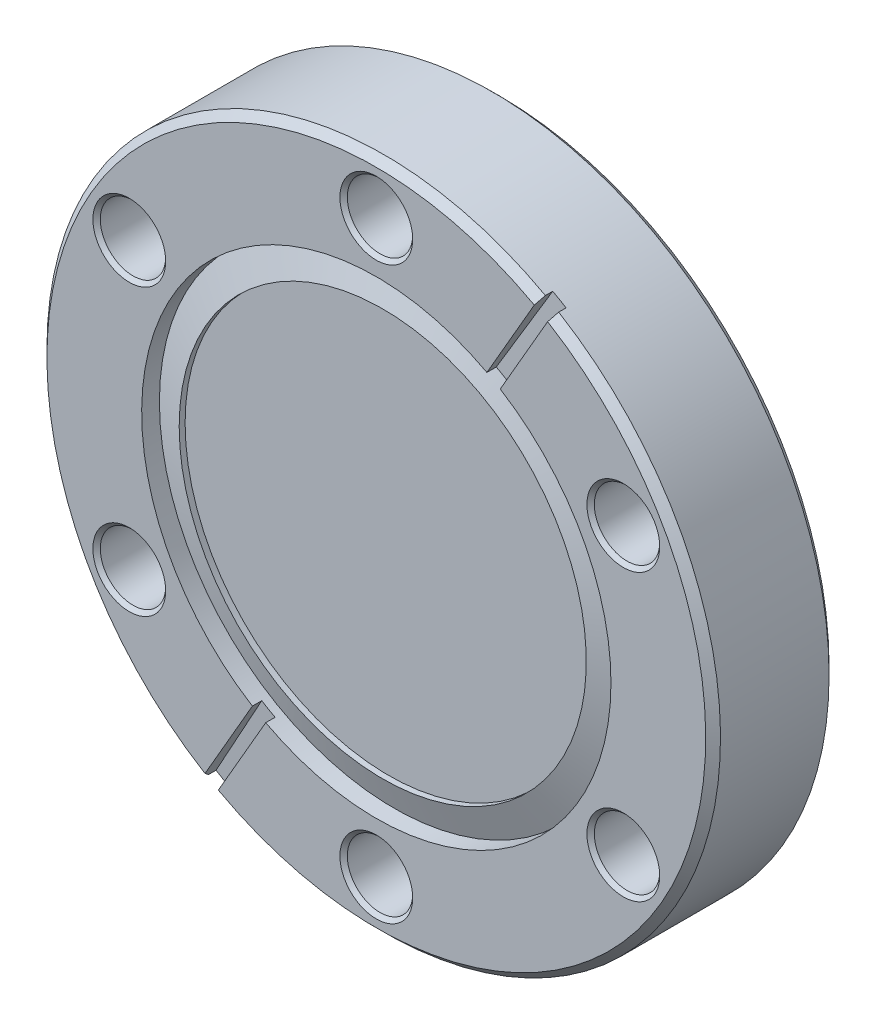
ISO-10303-21;
HEADER;
FILE_DESCRIPTION(('STEP AP214'),'2;1');
FILE_NAME('part.step','',(''),(''),'','','');
FILE_SCHEMA(('AUTOMOTIVE_DESIGN { 1 0 10303 214 1 1 1 1 }'));
ENDSEC;
DATA;
#1=APPLICATION_CONTEXT('core data for automotive mechanical design processes');
#2=APPLICATION_PROTOCOL_DEFINITION('international standard','automotive_design',2000,#1);
#3=PRODUCT_CONTEXT('',#1,'mechanical');
#4=PRODUCT('Part','Part','',(#3));
#5=PRODUCT_RELATED_PRODUCT_CATEGORY('part','',(#4));
#6=PRODUCT_DEFINITION_FORMATION('','',#4);
#7=PRODUCT_DEFINITION_CONTEXT('part definition',#1,'design');
#8=PRODUCT_DEFINITION('design','',#6,#7);
#9=PRODUCT_DEFINITION_SHAPE('','',#8);
#10=(LENGTH_UNIT() NAMED_UNIT(*) SI_UNIT(.MILLI.,.METRE.));
#11=(NAMED_UNIT(*) PLANE_ANGLE_UNIT() SI_UNIT($,.RADIAN.));
#12=(NAMED_UNIT(*) SI_UNIT($,.STERADIAN.) SOLID_ANGLE_UNIT());
#13=UNCERTAINTY_MEASURE_WITH_UNIT(LENGTH_MEASURE(1.E-05),#10,'distance_accuracy_value','');
#14=(GEOMETRIC_REPRESENTATION_CONTEXT(3) GLOBAL_UNCERTAINTY_ASSIGNED_CONTEXT((#13)) GLOBAL_UNIT_ASSIGNED_CONTEXT((#10,
#11,#12)) REPRESENTATION_CONTEXT('',''));
#15=CARTESIAN_POINT('',(0.,0.,0.));
#16=DIRECTION('',(0.,0.,1.));
#17=DIRECTION('',(1.,0.,0.));
#18=AXIS2_PLACEMENT_3D('',#15,#16,#17);
#19=CARTESIAN_POINT('',(0.,0.,0.));
#20=DIRECTION('',(0.,0.,-1.));
#21=DIRECTION('',(-1.,0.,0.));
#22=AXIS2_PLACEMENT_3D('',#19,#20,#21);
#23=CYLINDRICAL_SURFACE('',#22,34.671);
#24=CARTESIAN_POINT('',(0.,0.,-11.9379999999998));
#25=DIRECTION('',(0.,0.,-1.));
#26=DIRECTION('',(-1.,0.,0.));
#27=AXIS2_PLACEMENT_3D('',#24,#25,#26);
#28=CIRCLE('',#27,34.671);
#29=CARTESIAN_POINT('',(-34.671,0.,-11.9379999999998));
#30=VERTEX_POINT('',#29);
#31=EDGE_CURVE('E448',#30,#30,#28,.F.);
#32=ORIENTED_EDGE('',*,*,#31,.T.);
#33=EDGE_LOOP('',(#32));
#34=FACE_BOUND('',#33,.T.);
#35=DIRECTION('',(0.,0.,-1.));
#36=VECTOR('',#35,1.);
#37=CARTESIAN_POINT('',(-18.0183640857662,-29.6212220658203,-0.96573949798635));
#38=LINE('',#37,#36);
#39=CARTESIAN_POINT('',(-18.0183640857662,-29.6212220658203,-0.761999999999931));
#40=VERTEX_POINT('',#39);
#41=CARTESIAN_POINT('',(-18.0183640857667,-29.6212220658211,-1.51704615798749));
#42=VERTEX_POINT('',#41);
#43=EDGE_CURVE('E169',#40,#42,#38,.T.);
#44=ORIENTED_EDGE('',*,*,#43,.F.);
#45=CARTESIAN_POINT('',(0.,0.,-0.761999999999931));
#46=DIRECTION('',(0.,0.,-1.));
#47=DIRECTION('',(-1.,0.,0.));
#48=AXIS2_PLACEMENT_3D('',#45,#46,#47);
#49=CIRCLE('',#48,34.671);
#50=CARTESIAN_POINT('',(16.6435487572577,30.4149720658207,-0.761999999998031));
#51=VERTEX_POINT('',#50);
#52=EDGE_CURVE('E345',#40,#51,#49,.T.);
#53=ORIENTED_EDGE('',*,*,#52,.T.);
#54=DIRECTION('',(0.,0.,-1.));
#55=VECTOR('',#54,1.);
#56=CARTESIAN_POINT('',(16.6435487572577,30.4149720658207,-0.96573949798635));
#57=LINE('',#56,#55);
#58=CARTESIAN_POINT('',(16.6435487572579,30.4149720658217,-1.51704615798749));
#59=VERTEX_POINT('',#58);
#60=EDGE_CURVE('E167',#51,#59,#57,.T.);
#61=ORIENTED_EDGE('',*,*,#60,.T.);
#62=CARTESIAN_POINT('',(0.,0.,0.299507719817739));
#63=DIRECTION('',(-0.0261679781214693,-0.0453242676377388,-0.998629534754574));
#64=DIRECTION('',(0.499314767377261,0.864838546066911,-0.0523359562429414));
#65=AXIS2_PLACEMENT_3D('',#62,#63,#64);
#66=ELLIPSE('',#65,34.7185806080939,34.671);
#67=CARTESIAN_POINT('',(18.0183640857672,29.6212220658219,-1.51704615798749));
#68=VERTEX_POINT('',#67);
#69=EDGE_CURVE('E259',#59,#68,#66,.T.);
#70=ORIENTED_EDGE('',*,*,#69,.T.);
#71=DIRECTION('',(0.,0.,-1.));
#72=VECTOR('',#71,1.);
#73=CARTESIAN_POINT('',(18.018364085766,29.6212220658226,-0.965739497986353));
#74=LINE('',#73,#72);
#75=CARTESIAN_POINT('',(18.018364085766,29.6212220658226,-0.761999999999943));
#76=VERTEX_POINT('',#75);
#77=EDGE_CURVE('E173',#76,#68,#74,.T.);
#78=ORIENTED_EDGE('',*,*,#77,.F.);
#79=CARTESIAN_POINT('',(0.,0.,-0.761999999999943));
#80=DIRECTION('',(0.,0.,-1.));
#81=DIRECTION('',(-1.,0.,0.));
#82=AXIS2_PLACEMENT_3D('',#79,#80,#81);
#83=CIRCLE('',#82,34.671);
#84=CARTESIAN_POINT('',(-16.6435487572595,-30.4149720658219,-0.761999999999942));
#85=VERTEX_POINT('',#84);
#86=EDGE_CURVE('E927',#76,#85,#83,.T.);
#87=ORIENTED_EDGE('',*,*,#86,.T.);
#88=DIRECTION('',(0.,0.,-1.));
#89=VECTOR('',#88,1.);
#90=CARTESIAN_POINT('',(-16.6435487572595,-30.4149720658219,-0.965739497986353));
#91=LINE('',#90,#89);
#92=CARTESIAN_POINT('',(-16.6435487572585,-30.4149720658224,-1.51704615798749));
#93=VERTEX_POINT('',#92);
#94=EDGE_CURVE('E171',#85,#93,#91,.T.);
#95=ORIENTED_EDGE('',*,*,#94,.T.);
#96=CARTESIAN_POINT('',(0.,0.,0.299507719817694));
#97=DIRECTION('',(-0.0261679781214693,-0.0453242676377388,0.998629534754574));
#98=DIRECTION('',(-0.499314767377261,-0.864838546066911,-0.0523359562429414));
#99=AXIS2_PLACEMENT_3D('',#96,#97,#98);
#100=ELLIPSE('',#99,34.7185806080939,34.671);
#101=EDGE_CURVE('E239',#42,#93,#100,.T.);
#102=ORIENTED_EDGE('',*,*,#101,.F.);
#103=EDGE_LOOP('',(#44,#53,#61,#70,#78,#87,#95,#102));
#104=FACE_BOUND('',#103,.T.);
#105=ADVANCED_FACE('F43',(#34,#104),#23,.T.);
#106=CARTESIAN_POINT('',(0.,0.,-1.91651285463287));
#107=DIRECTION('',(0.,0.,1.));
#108=DIRECTION('',(1.,0.,0.));
#109=AXIS2_PLACEMENT_3D('',#106,#107,#108);
#110=CYLINDRICAL_SURFACE('',#109,24.1554);
#111=CARTESIAN_POINT('',(0.,0.,0.29950771981774));
#112=DIRECTION('',(-0.0261679781214693,-0.0453242676377388,-0.998629534754574));
#113=DIRECTION('',(-0.499314767377261,-0.864838546066911,0.0523359562429414));
#114=AXIS2_PLACEMENT_3D('',#111,#112,#113);
#115=ELLIPSE('',#114,24.1885495665182,24.1554);
#116=CARTESIAN_POINT('',(12.7585852175989,20.511017829578,-0.965739497986353));
#117=VERTEX_POINT('',#116);
#118=CARTESIAN_POINT('',(11.3837698890904,21.3047678295784,-0.965739497986328));
#119=VERTEX_POINT('',#118);
#120=EDGE_CURVE('E310',#117,#119,#115,.F.);
#121=ORIENTED_EDGE('',*,*,#120,.T.);
#122=DIRECTION('',(0.,0.,-1.));
#123=VECTOR('',#122,1.);
#124=CARTESIAN_POINT('',(11.3837698890914,21.3047678295779,0.));
#125=LINE('',#124,#123);
#126=CARTESIAN_POINT('',(11.3837698890914,21.3047678295779,0.));
#127=VERTEX_POINT('',#126);
#128=EDGE_CURVE('E143',#127,#119,#125,.T.);
#129=ORIENTED_EDGE('',*,*,#128,.F.);
#130=CARTESIAN_POINT('',(0.,0.,0.));
#131=DIRECTION('',(0.,0.,-1.));
#132=DIRECTION('',(1.,0.,0.));
#133=AXIS2_PLACEMENT_3D('',#130,#131,#132);
#134=CIRCLE('',#133,24.1554);
#135=CARTESIAN_POINT('',(-12.7585852175989,-20.511017829578,0.));
#136=VERTEX_POINT('',#135);
#137=EDGE_CURVE('E127',#136,#127,#134,.T.);
#138=ORIENTED_EDGE('',*,*,#137,.F.);
#139=DIRECTION('',(0.,0.,-1.));
#140=VECTOR('',#139,1.);
#141=CARTESIAN_POINT('',(-12.7585852175989,-20.511017829578,0.));
#142=LINE('',#141,#140);
#143=CARTESIAN_POINT('',(-12.7585852175989,-20.511017829578,-0.965739497986328));
#144=VERTEX_POINT('',#143);
#145=EDGE_CURVE('E136',#136,#144,#142,.T.);
#146=ORIENTED_EDGE('',*,*,#145,.T.);
#147=CARTESIAN_POINT('',(0.,0.,0.299507719817694));
#148=DIRECTION('',(-0.0261679781214693,-0.0453242676377388,0.998629534754574));
#149=DIRECTION('',(0.499314767377261,0.864838546066911,0.0523359562429414));
#150=AXIS2_PLACEMENT_3D('',#147,#148,#149);
#151=ELLIPSE('',#150,24.1885495665182,24.1554);
#152=CARTESIAN_POINT('',(-11.3837698890905,-21.3047678295783,-0.965739497986353));
#153=VERTEX_POINT('',#152);
#154=EDGE_CURVE('E244',#153,#144,#151,.F.);
#155=ORIENTED_EDGE('',*,*,#154,.F.);
#156=DIRECTION('',(0.,0.,-1.));
#157=VECTOR('',#156,1.);
#158=CARTESIAN_POINT('',(-11.3837698890914,-21.3047678295779,0.));
#159=LINE('',#158,#157);
#160=CARTESIAN_POINT('',(-11.3837698890914,-21.3047678295779,0.));
#161=VERTEX_POINT('',#160);
#162=EDGE_CURVE('E161',#161,#153,#159,.T.);
#163=ORIENTED_EDGE('',*,*,#162,.F.);
#164=CARTESIAN_POINT('',(0.,0.,0.));
#165=DIRECTION('',(0.,0.,-1.));
#166=DIRECTION('',(1.,0.,0.));
#167=AXIS2_PLACEMENT_3D('',#164,#165,#166);
#168=CIRCLE('',#167,24.1554);
#169=CARTESIAN_POINT('',(12.758585217598,20.5110178295785,0.));
#170=VERTEX_POINT('',#169);
#171=EDGE_CURVE('E157',#170,#161,#168,.T.);
#172=ORIENTED_EDGE('',*,*,#171,.F.);
#173=DIRECTION('',(0.,0.,-1.));
#174=VECTOR('',#173,1.);
#175=CARTESIAN_POINT('',(12.758585217598,20.5110178295785,0.));
#176=LINE('',#175,#174);
#177=EDGE_CURVE('E164',#170,#117,#176,.T.);
#178=ORIENTED_EDGE('',*,*,#177,.T.);
#179=EDGE_LOOP('',(#121,#129,#138,#146,#155,#163,#172,#178));
#180=FACE_BOUND('',#179,.T.);
#181=CARTESIAN_POINT('',(0.,0.,-1.82525033774552));
#182=DIRECTION('',(0.,0.,1.));
#183=DIRECTION('',(1.,0.,0.));
#184=AXIS2_PLACEMENT_3D('',#181,#182,#183);
#185=CIRCLE('',#184,24.1554);
#186=CARTESIAN_POINT('',(24.1554,0.,-1.82525033774552));
#187=VERTEX_POINT('',#186);
#188=EDGE_CURVE('E252',#187,#187,#185,.T.);
#189=ORIENTED_EDGE('',*,*,#188,.F.);
#190=EDGE_LOOP('',(#189));
#191=FACE_BOUND('',#190,.T.);
#192=ADVANCED_FACE('F146',(#180,#191),#110,.F.);
#193=CARTESIAN_POINT('',(0.,0.,-12.7));
#194=DIRECTION('',(0.,0.,-1.));
#195=DIRECTION('',(-1.,0.,0.));
#196=AXIS2_PLACEMENT_3D('',#193,#194,#195);
#197=PLANE('',#196);
#198=CARTESIAN_POINT('',(0.,0.,-12.7));
#199=DIRECTION('',(0.,0.,-1.));
#200=DIRECTION('',(-1.,0.,0.));
#201=AXIS2_PLACEMENT_3D('',#198,#199,#200);
#202=CIRCLE('',#201,33.909);
#203=CARTESIAN_POINT('',(-33.909,0.,-12.7));
#204=VERTEX_POINT('',#203);
#205=EDGE_CURVE('E12',#204,#204,#202,.T.);
#206=ORIENTED_EDGE('',*,*,#205,.T.);
#207=EDGE_LOOP('',(#206));
#208=FACE_BOUND('',#207,.T.);
#209=CARTESIAN_POINT('',(25.428584316085,-14.6812,-12.7));
#210=DIRECTION('',(0.,0.,-1.));
#211=DIRECTION('',(-1.,0.,0.));
#212=AXIS2_PLACEMENT_3D('',#209,#210,#211);
#213=CIRCLE('',#212,3.74649999997987);
#214=CARTESIAN_POINT('',(21.6820843161051,-14.6812,-12.7));
#215=VERTEX_POINT('',#214);
#216=EDGE_CURVE('E571',#215,#215,#213,.F.);
#217=ORIENTED_EDGE('',*,*,#216,.T.);
#218=EDGE_LOOP('',(#217));
#219=FACE_BOUND('',#218,.T.);
#220=CARTESIAN_POINT('',(0.,29.3624,-12.7));
#221=DIRECTION('',(0.,0.,-1.));
#222=DIRECTION('',(-1.,0.,0.));
#223=AXIS2_PLACEMENT_3D('',#220,#221,#222);
#224=CIRCLE('',#223,3.74649999997986);
#225=CARTESIAN_POINT('',(-3.74649999997986,29.3624,-12.7));
#226=VERTEX_POINT('',#225);
#227=EDGE_CURVE('E568',#226,#226,#224,.F.);
#228=ORIENTED_EDGE('',*,*,#227,.T.);
#229=EDGE_LOOP('',(#228));
#230=FACE_BOUND('',#229,.T.);
#231=CARTESIAN_POINT('',(-25.428584316085,-14.6812,-12.7));
#232=DIRECTION('',(0.,0.,-1.));
#233=DIRECTION('',(-1.,0.,0.));
#234=AXIS2_PLACEMENT_3D('',#231,#232,#233);
#235=CIRCLE('',#234,3.74649999997987);
#236=CARTESIAN_POINT('',(-29.1750843160649,-14.6812,-12.7));
#237=VERTEX_POINT('',#236);
#238=EDGE_CURVE('E563',#237,#237,#235,.F.);
#239=ORIENTED_EDGE('',*,*,#238,.T.);
#240=EDGE_LOOP('',(#239));
#241=FACE_BOUND('',#240,.T.);
#242=CARTESIAN_POINT('',(25.428584316085,14.6812,-12.7));
#243=DIRECTION('',(0.,0.,-1.));
#244=DIRECTION('',(-1.,0.,0.));
#245=AXIS2_PLACEMENT_3D('',#242,#243,#244);
#246=CIRCLE('',#245,3.74649999997985);
#247=CARTESIAN_POINT('',(21.6820843161051,14.6812,-12.7));
#248=VERTEX_POINT('',#247);
#249=EDGE_CURVE('E559',#248,#248,#246,.F.);
#250=ORIENTED_EDGE('',*,*,#249,.T.);
#251=EDGE_LOOP('',(#250));
#252=FACE_BOUND('',#251,.T.);
#253=CARTESIAN_POINT('',(0.,-29.3624,-12.7));
#254=DIRECTION('',(0.,0.,-1.));
#255=DIRECTION('',(-1.,0.,0.));
#256=AXIS2_PLACEMENT_3D('',#253,#254,#255);
#257=CIRCLE('',#256,3.74649999997986);
#258=CARTESIAN_POINT('',(-3.74649999997986,-29.3624,-12.7));
#259=VERTEX_POINT('',#258);
#260=EDGE_CURVE('E557',#259,#259,#257,.F.);
#261=ORIENTED_EDGE('',*,*,#260,.T.);
#262=EDGE_LOOP('',(#261));
#263=FACE_BOUND('',#262,.T.);
#264=CARTESIAN_POINT('',(-25.428584316085,14.6812,-12.7));
#265=DIRECTION('',(0.,0.,-1.));
#266=DIRECTION('',(-1.,0.,0.));
#267=AXIS2_PLACEMENT_3D('',#264,#265,#266);
#268=CIRCLE('',#267,3.74649999997987);
#269=CARTESIAN_POINT('',(-29.1750843160649,14.6812,-12.7));
#270=VERTEX_POINT('',#269);
#271=EDGE_CURVE('E258',#270,#270,#268,.F.);
#272=ORIENTED_EDGE('',*,*,#271,.T.);
#273=EDGE_LOOP('',(#272));
#274=FACE_BOUND('',#273,.T.);
#275=ADVANCED_FACE('F378',(#208,#219,#230,#241,#252,#263,#274),#197,.T.);
#276=CARTESIAN_POINT('',(0.,0.,-1.8252503377459));
#277=DIRECTION('',(0.,0.,-1.));
#278=DIRECTION('',(-1.,0.,0.));
#279=AXIS2_PLACEMENT_3D('',#276,#277,#278);
#280=CONICAL_SURFACE('',#279,24.1553999999999,1.2217304763958);
#281=CARTESIAN_POINT('',(0.,0.,-0.660399999999613));
#282=DIRECTION('',(0.,0.,1.));
#283=DIRECTION('',(-1.,0.,0.));
#284=AXIS2_PLACEMENT_3D('',#281,#282,#283);
#285=CIRCLE('',#284,20.955);
#286=CARTESIAN_POINT('',(-20.955,0.,-0.660399999999613));
#287=VERTEX_POINT('',#286);
#288=EDGE_CURVE('E931',#287,#287,#285,.T.);
#289=ORIENTED_EDGE('',*,*,#288,.F.);
#290=EDGE_LOOP('',(#289));
#291=FACE_BOUND('',#290,.T.);
#292=ORIENTED_EDGE('',*,*,#188,.T.);
#293=EDGE_LOOP('',(#292));
#294=FACE_BOUND('',#293,.T.);
#295=ADVANCED_FACE('F374',(#291,#294),#280,.T.);
#296=CARTESIAN_POINT('',(12.5111076642548,20.0823741334518,-0.9398));
#297=DIRECTION('',(-0.0261679781214693,-0.0453242676377388,-0.998629534754574));
#298=DIRECTION('',(0.,0.998971622769016,-0.0453397938045331));
#299=AXIS2_PLACEMENT_3D('',#296,#297,#298);
#300=PLANE('',#299);
#301=ORIENTED_EDGE('',*,*,#120,.F.);
#302=DIRECTION('',(0.499314767377303,0.864838546066885,-0.052335956242967));
#303=VECTOR('',#302,1.);
#304=CARTESIAN_POINT('',(12.7585852175996,20.5110178295789,-0.96573949798628));
#305=LINE('',#304,#303);
#306=EDGE_CURVE('E305',#117,#68,#305,.T.);
#307=ORIENTED_EDGE('',*,*,#306,.T.);
#308=ORIENTED_EDGE('',*,*,#69,.F.);
#309=DIRECTION('',(0.499314767377303,0.864838546066885,-0.052335956242967));
#310=VECTOR('',#309,1.);
#311=CARTESIAN_POINT('',(11.3837698890915,21.3047678295781,-0.96573949798628));
#312=LINE('',#311,#310);
#313=EDGE_CURVE('E318',#119,#59,#312,.T.);
#314=ORIENTED_EDGE('',*,*,#313,.F.);
#315=EDGE_LOOP('',(#301,#307,#308,#314));
#316=FACE_BOUND('',#315,.T.);
#317=ADVANCED_FACE('F371',(#316),#300,.F.);
#318=CARTESIAN_POINT('',(-11.1362923357452,-20.8761241334518,-0.9398));
#319=DIRECTION('',(-0.0261679781214693,-0.0453242676377388,0.998629534754574));
#320=DIRECTION('',(0.,-0.998971622769016,-0.0453397938045331));
#321=AXIS2_PLACEMENT_3D('',#318,#319,#320);
#322=PLANE('',#321);
#323=DIRECTION('',(-0.499314767377303,-0.864838546066885,-0.052335956242967));
#324=VECTOR('',#323,1.);
#325=CARTESIAN_POINT('',(-12.7585852175996,-20.5110178295789,-0.96573949798628));
#326=LINE('',#325,#324);
#327=EDGE_CURVE('E139',#144,#42,#326,.T.);
#328=ORIENTED_EDGE('',*,*,#327,.T.);
#329=ORIENTED_EDGE('',*,*,#101,.T.);
#330=DIRECTION('',(-0.499314767377303,-0.864838546066885,-0.052335956242967));
#331=VECTOR('',#330,1.);
#332=CARTESIAN_POINT('',(-11.3837698890915,-21.3047678295781,-0.96573949798628));
#333=LINE('',#332,#331);
#334=EDGE_CURVE('E175',#153,#93,#333,.T.);
#335=ORIENTED_EDGE('',*,*,#334,.F.);
#336=ORIENTED_EDGE('',*,*,#154,.T.);
#337=EDGE_LOOP('',(#328,#329,#335,#336));
#338=FACE_BOUND('',#337,.T.);
#339=ADVANCED_FACE('F332',(#338),#322,.T.);
#340=CARTESIAN_POINT('',(12.758585217598,20.5110178295785,-0.965739497986353));
#341=DIRECTION('',(0.866025403784439,-0.5,0.));
#342=DIRECTION('',(0.5,0.866025403784439,0.));
#343=AXIS2_PLACEMENT_3D('',#340,#341,#342);
#344=PLANE('',#343);
#345=DIRECTION('',(-0.5,-0.866025403784439,0.));
#346=VECTOR('',#345,1.);
#347=CARTESIAN_POINT('',(12.758585217598,20.5110178295785,0.));
#348=LINE('',#347,#346);
#349=CARTESIAN_POINT('',(17.6372619552014,28.9611338128119,0.));
#350=VERTEX_POINT('',#349);
#351=EDGE_CURVE('E142',#350,#170,#348,.T.);
#352=ORIENTED_EDGE('',*,*,#351,.F.);
#353=CARTESIAN_POINT('',(17.6372619552014,28.9611338128119,0.));
#354=CARTESIAN_POINT('',(17.7007791661182,29.0711488492748,-0.126999621586548));
#355=CARTESIAN_POINT('',(17.764296282457,29.1811637219239,-0.253999432379819));
#356=CARTESIAN_POINT('',(17.8913303259785,29.4011931395941,-0.507999432379799));
#357=CARTESIAN_POINT('',(17.9548472531613,29.5112076846153,-0.634999621586509));
#358=CARTESIAN_POINT('',(18.018364085766,29.6212220658226,-0.76199999999994));
#359=B_SPLINE_CURVE_WITH_KNOTS('',3,(#353,#354,#355,#356,#357,#358),.UNSPECIFIED.,.F.,.F.,(4,2,
4),(0.,0.538887589318551,1.07777517863708),.UNSPECIFIED.);
#360=EDGE_CURVE('E65',#350,#76,#359,.T.);
#361=ORIENTED_EDGE('',*,*,#360,.T.);
#362=ORIENTED_EDGE('',*,*,#77,.T.);
#363=ORIENTED_EDGE('',*,*,#306,.F.);
#364=ORIENTED_EDGE('',*,*,#177,.F.);
#365=EDGE_LOOP('',(#352,#361,#362,#363,#364));
#366=FACE_BOUND('',#365,.T.);
#367=ADVANCED_FACE('F362',(#366),#344,.F.);
#368=CARTESIAN_POINT('',(-16.6435487572595,-30.4149720658219,-0.965739497986353));
#369=DIRECTION('',(0.866025403784439,-0.5,0.));
#370=DIRECTION('',(0.5,0.866025403784439,0.));
#371=AXIS2_PLACEMENT_3D('',#368,#369,#370);
#372=PLANE('',#371);
#373=ORIENTED_EDGE('',*,*,#94,.F.);
#374=CARTESIAN_POINT('',(-16.6435487572595,-30.4149720658219,-0.761999999999943));
#375=CARTESIAN_POINT('',(-16.5800319246548,-30.3049576846146,-0.63499962158651));
#376=CARTESIAN_POINT('',(-16.516514997472,-30.1949431395934,-0.5079994323798));
#377=CARTESIAN_POINT('',(-16.3894809539505,-29.9749137219231,-0.253999432379819));
#378=CARTESIAN_POINT('',(-16.3259638376117,-29.8648988492741,-0.126999621586548));
#379=CARTESIAN_POINT('',(-16.2624466266949,-29.7548838128111,0.));
#380=B_SPLINE_CURVE_WITH_KNOTS('',3,(#374,#375,#376,#377,#378,#379),.UNSPECIFIED.,.F.,.F.,(4,2,
4),(0.,0.538887589318528,1.07777517863708),.UNSPECIFIED.);
#381=CARTESIAN_POINT('',(-16.2624466266949,-29.7548838128111,0.));
#382=VERTEX_POINT('',#381);
#383=EDGE_CURVE('E51',#85,#382,#380,.T.);
#384=ORIENTED_EDGE('',*,*,#383,.T.);
#385=DIRECTION('',(-0.500000000000017,-0.866025403784429,0.));
#386=VECTOR('',#385,1.);
#387=CARTESIAN_POINT('',(-16.6435487572595,-30.4149720658219,0.));
#388=LINE('',#387,#386);
#389=EDGE_CURVE('E159',#161,#382,#388,.T.);
#390=ORIENTED_EDGE('',*,*,#389,.F.);
#391=ORIENTED_EDGE('',*,*,#162,.T.);
#392=ORIENTED_EDGE('',*,*,#334,.T.);
#393=EDGE_LOOP('',(#373,#384,#390,#391,#392));
#394=FACE_BOUND('',#393,.T.);
#395=ADVANCED_FACE('F336',(#394),#372,.F.);
#396=CARTESIAN_POINT('',(16.6435487572577,30.4149720658207,-0.96573949798635));
#397=DIRECTION('',(-0.866025403784475,0.499999999999937,0.));
#398=DIRECTION('',(-0.499999999999937,-0.866025403784475,0.));
#399=AXIS2_PLACEMENT_3D('',#396,#397,#398);
#400=PLANE('',#399);
#401=ORIENTED_EDGE('',*,*,#60,.F.);
#402=CARTESIAN_POINT('',(16.6435487572587,30.4149720658224,-0.761999999999931));
#403=CARTESIAN_POINT('',(16.5800319246539,30.3049576846151,-0.634999621586504));
#404=CARTESIAN_POINT('',(16.5165149974712,30.1949431395938,-0.5079994323798));
#405=CARTESIAN_POINT('',(16.3894809539497,29.9749137219236,-0.25399943237983));
#406=CARTESIAN_POINT('',(16.3259638376109,29.8648988492745,-0.126999621586565));
#407=CARTESIAN_POINT('',(16.2624466266941,29.7548838128116,0.));
#408=B_SPLINE_CURVE_WITH_KNOTS('',3,(#402,#403,#404,#405,#406,#407),.UNSPECIFIED.,.F.,.F.,(4,2,
4),(0.,0.538887589318506,1.07777517863704),.UNSPECIFIED.);
#409=CARTESIAN_POINT('',(16.2624466266941,29.7548838128116,0.));
#410=VERTEX_POINT('',#409);
#411=EDGE_CURVE('E342',#51,#410,#408,.T.);
#412=ORIENTED_EDGE('',*,*,#411,.T.);
#413=DIRECTION('',(0.499999999999937,0.866025403784475,0.));
#414=VECTOR('',#413,1.);
#415=CARTESIAN_POINT('',(16.6435487572587,30.4149720658224,0.));
#416=LINE('',#415,#414);
#417=EDGE_CURVE('E150',#127,#410,#416,.T.);
#418=ORIENTED_EDGE('',*,*,#417,.F.);
#419=ORIENTED_EDGE('',*,*,#128,.T.);
#420=ORIENTED_EDGE('',*,*,#313,.T.);
#421=EDGE_LOOP('',(#401,#412,#418,#419,#420));
#422=FACE_BOUND('',#421,.T.);
#423=ADVANCED_FACE('F453',(#422),#400,.F.);
#424=CARTESIAN_POINT('',(-12.7585852175989,-20.511017829578,-0.96573949798635));
#425=DIRECTION('',(-0.866025403784421,0.500000000000031,0.));
#426=DIRECTION('',(-0.500000000000031,-0.866025403784421,0.));
#427=AXIS2_PLACEMENT_3D('',#424,#425,#426);
#428=PLANE('',#427);
#429=DIRECTION('',(0.500000000000031,0.866025403784421,0.));
#430=VECTOR('',#429,1.);
#431=CARTESIAN_POINT('',(-12.7585852175989,-20.511017829578,0.));
#432=LINE('',#431,#430);
#433=CARTESIAN_POINT('',(-17.6372619552025,-28.9611338128112,0.));
#434=VERTEX_POINT('',#433);
#435=EDGE_CURVE('E122',#434,#136,#432,.T.);
#436=ORIENTED_EDGE('',*,*,#435,.F.);
#437=CARTESIAN_POINT('',(-17.6372619552025,-28.9611338128112,0.));
#438=CARTESIAN_POINT('',(-17.7007791661193,-29.0711488492742,-0.126999621586565));
#439=CARTESIAN_POINT('',(-17.7642962824581,-29.1811637219232,-0.25399943237983));
#440=CARTESIAN_POINT('',(-17.8913303259796,-29.4011931395934,-0.507999432379799));
#441=CARTESIAN_POINT('',(-17.9548472531624,-29.5112076846146,-0.634999621586504));
#442=CARTESIAN_POINT('',(-18.0183640857672,-29.6212220658219,-0.761999999999932));
#443=B_SPLINE_CURVE_WITH_KNOTS('',3,(#437,#438,#439,#440,#441,#442),.UNSPECIFIED.,.F.,.F.,(4,2,
4),(0.,0.538887589318532,1.07777517863703),.UNSPECIFIED.);
#444=EDGE_CURVE('E442',#434,#40,#443,.T.);
#445=ORIENTED_EDGE('',*,*,#444,.T.);
#446=ORIENTED_EDGE('',*,*,#43,.T.);
#447=ORIENTED_EDGE('',*,*,#327,.F.);
#448=ORIENTED_EDGE('',*,*,#145,.F.);
#449=EDGE_LOOP('',(#436,#445,#446,#447,#448));
#450=FACE_BOUND('',#449,.T.);
#451=ADVANCED_FACE('F137',(#450),#428,.F.);
#452=CARTESIAN_POINT('',(0.,0.,0.));
#453=DIRECTION('',(0.,0.,-1.));
#454=DIRECTION('',(-1.,0.,0.));
#455=AXIS2_PLACEMENT_3D('',#452,#453,#454);
#456=PLANE('',#455);
#457=CARTESIAN_POINT('',(25.428584316085,14.6812,0.));
#458=DIRECTION('',(0.,0.,-1.));
#459=DIRECTION('',(-1.,0.,0.));
#460=AXIS2_PLACEMENT_3D('',#457,#458,#459);
#461=CIRCLE('',#460,3.74649999997985);
#462=CARTESIAN_POINT('',(21.6820843161051,14.6812,0.));
#463=VERTEX_POINT('',#462);
#464=EDGE_CURVE('E532',#463,#463,#461,.T.);
#465=ORIENTED_EDGE('',*,*,#464,.T.);
#466=EDGE_LOOP('',(#465));
#467=FACE_BOUND('',#466,.T.);
#468=CARTESIAN_POINT('',(25.428584316085,-14.6812,0.));
#469=DIRECTION('',(0.,0.,-1.));
#470=DIRECTION('',(-1.,0.,0.));
#471=AXIS2_PLACEMENT_3D('',#468,#469,#470);
#472=CIRCLE('',#471,3.74649999997981);
#473=CARTESIAN_POINT('',(21.6820843161052,-14.6812,0.));
#474=VERTEX_POINT('',#473);
#475=EDGE_CURVE('E529',#474,#474,#472,.T.);
#476=ORIENTED_EDGE('',*,*,#475,.T.);
#477=EDGE_LOOP('',(#476));
#478=FACE_BOUND('',#477,.T.);
#479=CARTESIAN_POINT('',(0.,-29.3624,0.));
#480=DIRECTION('',(0.,0.,-1.));
#481=DIRECTION('',(-1.,0.,0.));
#482=AXIS2_PLACEMENT_3D('',#479,#480,#481);
#483=CIRCLE('',#482,3.74649999997984);
#484=CARTESIAN_POINT('',(-3.74649999997984,-29.3624,0.));
#485=VERTEX_POINT('',#484);
#486=EDGE_CURVE('E526',#485,#485,#483,.T.);
#487=ORIENTED_EDGE('',*,*,#486,.T.);
#488=EDGE_LOOP('',(#487));
#489=FACE_BOUND('',#488,.T.);
#490=ORIENTED_EDGE('',*,*,#389,.T.);
#491=CARTESIAN_POINT('',(0.,0.,0.));
#492=DIRECTION('',(0.,0.,-1.));
#493=DIRECTION('',(-1.,0.,0.));
#494=AXIS2_PLACEMENT_3D('',#491,#492,#493);
#495=CIRCLE('',#494,33.9089999999998);
#496=EDGE_CURVE('E339',#382,#350,#495,.F.);
#497=ORIENTED_EDGE('',*,*,#496,.T.);
#498=ORIENTED_EDGE('',*,*,#351,.T.);
#499=ORIENTED_EDGE('',*,*,#171,.T.);
#500=EDGE_LOOP('',(#490,#497,#498,#499));
#501=FACE_BOUND('',#500,.T.);
#502=ADVANCED_FACE('F338',(#467,#478,#489,#501),#456,.F.);
#503=CARTESIAN_POINT('',(0.,0.,0.));
#504=DIRECTION('',(0.,0.,-1.));
#505=DIRECTION('',(-1.,0.,0.));
#506=AXIS2_PLACEMENT_3D('',#503,#504,#505);
#507=PLANE('',#506);
#508=CARTESIAN_POINT('',(0.,29.3624,0.));
#509=DIRECTION('',(0.,0.,-1.));
#510=DIRECTION('',(-1.,0.,0.));
#511=AXIS2_PLACEMENT_3D('',#508,#509,#510);
#512=CIRCLE('',#511,3.74649999997981);
#513=CARTESIAN_POINT('',(-3.74649999997981,29.3624,0.));
#514=VERTEX_POINT('',#513);
#515=EDGE_CURVE('E523',#514,#514,#512,.T.);
#516=ORIENTED_EDGE('',*,*,#515,.T.);
#517=EDGE_LOOP('',(#516));
#518=FACE_BOUND('',#517,.T.);
#519=CARTESIAN_POINT('',(-25.428584316085,-14.6812,0.));
#520=DIRECTION('',(0.,0.,-1.));
#521=DIRECTION('',(-1.,0.,0.));
#522=AXIS2_PLACEMENT_3D('',#519,#520,#521);
#523=CIRCLE('',#522,3.74649999997983);
#524=CARTESIAN_POINT('',(-29.1750843160648,-14.6812,0.));
#525=VERTEX_POINT('',#524);
#526=EDGE_CURVE('E520',#525,#525,#523,.T.);
#527=ORIENTED_EDGE('',*,*,#526,.T.);
#528=EDGE_LOOP('',(#527));
#529=FACE_BOUND('',#528,.T.);
#530=CARTESIAN_POINT('',(-25.428584316085,14.6812,0.));
#531=DIRECTION('',(0.,0.,-1.));
#532=DIRECTION('',(-1.,0.,0.));
#533=AXIS2_PLACEMENT_3D('',#530,#531,#532);
#534=CIRCLE('',#533,3.74649999997983);
#535=CARTESIAN_POINT('',(-29.1750843160648,14.6812,0.));
#536=VERTEX_POINT('',#535);
#537=EDGE_CURVE('E517',#536,#536,#534,.T.);
#538=ORIENTED_EDGE('',*,*,#537,.T.);
#539=EDGE_LOOP('',(#538));
#540=FACE_BOUND('',#539,.T.);
#541=ORIENTED_EDGE('',*,*,#417,.T.);
#542=CARTESIAN_POINT('',(0.,0.,0.));
#543=DIRECTION('',(0.,0.,-1.));
#544=DIRECTION('',(-1.,0.,0.));
#545=AXIS2_PLACEMENT_3D('',#542,#543,#544);
#546=CIRCLE('',#545,33.9089999999999);
#547=EDGE_CURVE('E130',#410,#434,#546,.F.);
#548=ORIENTED_EDGE('',*,*,#547,.T.);
#549=ORIENTED_EDGE('',*,*,#435,.T.);
#550=ORIENTED_EDGE('',*,*,#137,.T.);
#551=EDGE_LOOP('',(#541,#548,#549,#550));
#552=FACE_BOUND('',#551,.T.);
#553=ADVANCED_FACE('F125',(#518,#529,#540,#552),#507,.F.);
#554=CARTESIAN_POINT('',(0.,0.,-1.27));
#555=DIRECTION('',(0.,0.,1.));
#556=DIRECTION('',(1.,0.,0.));
#557=AXIS2_PLACEMENT_3D('',#554,#555,#556);
#558=CYLINDRICAL_SURFACE('',#557,20.955);
#559=CARTESIAN_POINT('',(0.,0.,-1.27));
#560=DIRECTION('',(0.,0.,1.));
#561=DIRECTION('',(-1.,0.,0.));
#562=AXIS2_PLACEMENT_3D('',#559,#560,#561);
#563=CIRCLE('',#562,20.955);
#564=CARTESIAN_POINT('',(-20.955,0.,-1.27));
#565=VERTEX_POINT('',#564);
#566=EDGE_CURVE('E132',#565,#565,#563,.T.);
#567=ORIENTED_EDGE('',*,*,#566,.F.);
#568=EDGE_LOOP('',(#567));
#569=FACE_BOUND('',#568,.T.);
#570=ORIENTED_EDGE('',*,*,#288,.T.);
#571=EDGE_LOOP('',(#570));
#572=FACE_BOUND('',#571,.T.);
#573=ADVANCED_FACE('F462',(#569,#572),#558,.F.);
#574=CARTESIAN_POINT('',(0.,0.,-1.27));
#575=DIRECTION('',(0.,0.,-1.));
#576=DIRECTION('',(-1.,0.,0.));
#577=AXIS2_PLACEMENT_3D('',#574,#575,#576);
#578=PLANE('',#577);
#579=ORIENTED_EDGE('',*,*,#566,.T.);
#580=EDGE_LOOP('',(#579));
#581=FACE_BOUND('',#580,.T.);
#582=ADVANCED_FACE('F466',(#581),#578,.F.);
#583=CARTESIAN_POINT('',(25.428584316085,14.6812,-12.7));
#584=DIRECTION('',(0.,0.,-1.));
#585=DIRECTION('',(-1.,0.,0.));
#586=AXIS2_PLACEMENT_3D('',#583,#584,#585);
#587=CYLINDRICAL_SURFACE('',#586,3.36549999999999);
#588=CARTESIAN_POINT('',(25.428584316085,14.6812,-0.380999999979847));
#589=DIRECTION('',(0.,0.,-1.));
#590=DIRECTION('',(-1.,0.,0.));
#591=AXIS2_PLACEMENT_3D('',#588,#589,#590);
#592=CIRCLE('',#591,3.36549999999999);
#593=CARTESIAN_POINT('',(22.063084316085,14.6812,-0.380999999979847));
#594=VERTEX_POINT('',#593);
#595=EDGE_CURVE('E538',#594,#594,#592,.F.);
#596=ORIENTED_EDGE('',*,*,#595,.T.);
#597=EDGE_LOOP('',(#596));
#598=FACE_BOUND('',#597,.T.);
#599=CARTESIAN_POINT('',(25.428584316085,14.6812,-12.3190000000201));
#600=DIRECTION('',(0.,0.,-1.));
#601=DIRECTION('',(-1.,0.,0.));
#602=AXIS2_PLACEMENT_3D('',#599,#600,#601);
#603=CIRCLE('',#602,3.36549999999999);
#604=CARTESIAN_POINT('',(22.063084316085,14.6812,-12.3190000000201));
#605=VERTEX_POINT('',#604);
#606=EDGE_CURVE('E535',#605,#605,#603,.T.);
#607=ORIENTED_EDGE('',*,*,#606,.T.);
#608=EDGE_LOOP('',(#607));
#609=FACE_BOUND('',#608,.T.);
#610=ADVANCED_FACE('F470',(#598,#609),#587,.F.);
#611=CARTESIAN_POINT('',(-25.428584316085,14.6812,0.));
#612=DIRECTION('',(0.,0.,1.));
#613=DIRECTION('',(1.,0.,0.));
#614=AXIS2_PLACEMENT_3D('',#611,#612,#613);
#615=CYLINDRICAL_SURFACE('',#614,3.36549999999999);
#616=CARTESIAN_POINT('',(-25.428584316085,14.6812,-12.3190000000201));
#617=DIRECTION('',(0.,0.,-1.));
#618=DIRECTION('',(-1.,0.,0.));
#619=AXIS2_PLACEMENT_3D('',#616,#617,#618);
#620=CIRCLE('',#619,3.36549999999999);
#621=CARTESIAN_POINT('',(-28.794084316085,14.6812,-12.3190000000201));
#622=VERTEX_POINT('',#621);
#623=EDGE_CURVE('E549',#622,#622,#620,.T.);
#624=ORIENTED_EDGE('',*,*,#623,.T.);
#625=EDGE_LOOP('',(#624));
#626=FACE_BOUND('',#625,.T.);
#627=CARTESIAN_POINT('',(-25.428584316085,14.6812,-0.380999999979852));
#628=DIRECTION('',(0.,0.,-1.));
#629=DIRECTION('',(-1.,0.,0.));
#630=AXIS2_PLACEMENT_3D('',#627,#628,#629);
#631=CIRCLE('',#630,3.36549999999999);
#632=CARTESIAN_POINT('',(-28.794084316085,14.6812,-0.380999999979852));
#633=VERTEX_POINT('',#632);
#634=EDGE_CURVE('E547',#633,#633,#631,.F.);
#635=ORIENTED_EDGE('',*,*,#634,.T.);
#636=EDGE_LOOP('',(#635));
#637=FACE_BOUND('',#636,.T.);
#638=ADVANCED_FACE('F474',(#626,#637),#615,.F.);
#639=CARTESIAN_POINT('',(-25.428584316085,-14.6812,0.));
#640=DIRECTION('',(0.,0.,1.));
#641=DIRECTION('',(1.,0.,0.));
#642=AXIS2_PLACEMENT_3D('',#639,#640,#641);
#643=CYLINDRICAL_SURFACE('',#642,3.36549999999999);
#644=CARTESIAN_POINT('',(-25.428584316085,-14.6812,-12.3190000000201));
#645=DIRECTION('',(0.,0.,-1.));
#646=DIRECTION('',(-1.,0.,0.));
#647=AXIS2_PLACEMENT_3D('',#644,#645,#646);
#648=CIRCLE('',#647,3.36549999999999);
#649=CARTESIAN_POINT('',(-28.794084316085,-14.6812,-12.3190000000201));
#650=VERTEX_POINT('',#649);
#651=EDGE_CURVE('E514',#650,#650,#648,.T.);
#652=ORIENTED_EDGE('',*,*,#651,.T.);
#653=EDGE_LOOP('',(#652));
#654=FACE_BOUND('',#653,.T.);
#655=CARTESIAN_POINT('',(-25.428584316085,-14.6812,-0.380999999979852));
#656=DIRECTION('',(0.,0.,-1.));
#657=DIRECTION('',(-1.,0.,0.));
#658=AXIS2_PLACEMENT_3D('',#655,#656,#657);
#659=CIRCLE('',#658,3.36549999999999);
#660=CARTESIAN_POINT('',(-28.794084316085,-14.6812,-0.380999999979852));
#661=VERTEX_POINT('',#660);
#662=EDGE_CURVE('E505',#661,#661,#659,.F.);
#663=ORIENTED_EDGE('',*,*,#662,.T.);
#664=EDGE_LOOP('',(#663));
#665=FACE_BOUND('',#664,.T.);
#666=ADVANCED_FACE('F478',(#654,#665),#643,.F.);
#667=CARTESIAN_POINT('',(0.,-29.3624,0.));
#668=DIRECTION('',(0.,0.,1.));
#669=DIRECTION('',(1.,0.,0.));
#670=AXIS2_PLACEMENT_3D('',#667,#668,#669);
#671=CYLINDRICAL_SURFACE('',#670,3.36549999999999);
#672=CARTESIAN_POINT('',(0.,-29.3624,-12.3190000000201));
#673=DIRECTION('',(0.,0.,-1.));
#674=DIRECTION('',(-1.,0.,0.));
#675=AXIS2_PLACEMENT_3D('',#672,#673,#674);
#676=CIRCLE('',#675,3.36549999999999);
#677=CARTESIAN_POINT('',(-3.36549999999999,-29.3624,-12.3190000000201));
#678=VERTEX_POINT('',#677);
#679=EDGE_CURVE('E544',#678,#678,#676,.T.);
#680=ORIENTED_EDGE('',*,*,#679,.T.);
#681=EDGE_LOOP('',(#680));
#682=FACE_BOUND('',#681,.T.);
#683=CARTESIAN_POINT('',(0.,-29.3624,-0.380999999979857));
#684=DIRECTION('',(0.,0.,-1.));
#685=DIRECTION('',(-1.,0.,0.));
#686=AXIS2_PLACEMENT_3D('',#683,#684,#685);
#687=CIRCLE('',#686,3.36549999999999);
#688=CARTESIAN_POINT('',(-3.36549999999999,-29.3624,-0.380999999979857));
#689=VERTEX_POINT('',#688);
#690=EDGE_CURVE('E541',#689,#689,#687,.F.);
#691=ORIENTED_EDGE('',*,*,#690,.T.);
#692=EDGE_LOOP('',(#691));
#693=FACE_BOUND('',#692,.T.);
#694=ADVANCED_FACE('F482',(#682,#693),#671,.F.);
#695=CARTESIAN_POINT('',(25.428584316085,-14.6812,0.));
#696=DIRECTION('',(0.,0.,1.));
#697=DIRECTION('',(1.,0.,0.));
#698=AXIS2_PLACEMENT_3D('',#695,#696,#697);
#699=CYLINDRICAL_SURFACE('',#698,3.36549999999999);
#700=CARTESIAN_POINT('',(25.428584316085,-14.6812,-12.3190000000201));
#701=DIRECTION('',(0.,0.,-1.));
#702=DIRECTION('',(-1.,0.,0.));
#703=AXIS2_PLACEMENT_3D('',#700,#701,#702);
#704=CIRCLE('',#703,3.36549999999999);
#705=CARTESIAN_POINT('',(22.063084316085,-14.6812,-12.3190000000201));
#706=VERTEX_POINT('',#705);
#707=EDGE_CURVE('E503',#706,#706,#704,.T.);
#708=ORIENTED_EDGE('',*,*,#707,.T.);
#709=EDGE_LOOP('',(#708));
#710=FACE_BOUND('',#709,.T.);
#711=CARTESIAN_POINT('',(25.428584316085,-14.6812,-0.380999999979815));
#712=DIRECTION('',(0.,0.,-1.));
#713=DIRECTION('',(-1.,0.,0.));
#714=AXIS2_PLACEMENT_3D('',#711,#712,#713);
#715=CIRCLE('',#714,3.36549999999999);
#716=CARTESIAN_POINT('',(22.063084316085,-14.6812,-0.380999999979815));
#717=VERTEX_POINT('',#716);
#718=EDGE_CURVE('E508',#717,#717,#715,.F.);
#719=ORIENTED_EDGE('',*,*,#718,.T.);
#720=EDGE_LOOP('',(#719));
#721=FACE_BOUND('',#720,.T.);
#722=ADVANCED_FACE('F486',(#710,#721),#699,.F.);
#723=CARTESIAN_POINT('',(0.,29.3624,0.));
#724=DIRECTION('',(0.,0.,1.));
#725=DIRECTION('',(1.,0.,0.));
#726=AXIS2_PLACEMENT_3D('',#723,#724,#725);
#727=CYLINDRICAL_SURFACE('',#726,3.36549999999999);
#728=CARTESIAN_POINT('',(0.,29.3624,-12.3190000000201));
#729=DIRECTION('',(0.,0.,-1.));
#730=DIRECTION('',(-1.,0.,0.));
#731=AXIS2_PLACEMENT_3D('',#728,#729,#730);
#732=CIRCLE('',#731,3.36549999999999);
#733=CARTESIAN_POINT('',(-3.36549999999999,29.3624,-12.3190000000201));
#734=VERTEX_POINT('',#733);
#735=EDGE_CURVE('E498',#734,#734,#732,.T.);
#736=ORIENTED_EDGE('',*,*,#735,.T.);
#737=EDGE_LOOP('',(#736));
#738=FACE_BOUND('',#737,.T.);
#739=CARTESIAN_POINT('',(0.,29.3624,-0.380999999979852));
#740=DIRECTION('',(0.,0.,-1.));
#741=DIRECTION('',(-1.,0.,0.));
#742=AXIS2_PLACEMENT_3D('',#739,#740,#741);
#743=CIRCLE('',#742,3.36549999999999);
#744=CARTESIAN_POINT('',(-3.36549999999999,29.3624,-0.380999999979852));
#745=VERTEX_POINT('',#744);
#746=EDGE_CURVE('E501',#745,#745,#743,.F.);
#747=ORIENTED_EDGE('',*,*,#746,.T.);
#748=EDGE_LOOP('',(#747));
#749=FACE_BOUND('',#748,.T.);
#750=ADVANCED_FACE('F392',(#738,#749),#727,.F.);
#751=CARTESIAN_POINT('',(25.428584316085,-14.6812,-12.7));
#752=DIRECTION('',(0.,0.,-1.));
#753=DIRECTION('',(-1.,0.,0.));
#754=AXIS2_PLACEMENT_3D('',#751,#752,#753);
#755=CONICAL_SURFACE('',#754,3.74649999997987,0.785398163397469);
#756=ORIENTED_EDGE('',*,*,#707,.F.);
#757=EDGE_LOOP('',(#756));
#758=FACE_BOUND('',#757,.T.);
#759=ORIENTED_EDGE('',*,*,#216,.F.);
#760=EDGE_LOOP('',(#759));
#761=FACE_BOUND('',#760,.T.);
#762=ADVANCED_FACE('F388',(#758,#761),#755,.F.);
#763=CARTESIAN_POINT('',(0.,29.3624,-12.7));
#764=DIRECTION('',(0.,0.,-1.));
#765=DIRECTION('',(-1.,0.,0.));
#766=AXIS2_PLACEMENT_3D('',#763,#764,#765);
#767=CONICAL_SURFACE('',#766,3.74649999997986,0.785398163397443);
#768=ORIENTED_EDGE('',*,*,#735,.F.);
#769=EDGE_LOOP('',(#768));
#770=FACE_BOUND('',#769,.T.);
#771=ORIENTED_EDGE('',*,*,#227,.F.);
#772=EDGE_LOOP('',(#771));
#773=FACE_BOUND('',#772,.T.);
#774=ADVANCED_FACE('F391',(#770,#773),#767,.F.);
#775=CARTESIAN_POINT('',(-25.428584316085,-14.6812,-12.7));
#776=DIRECTION('',(0.,0.,-1.));
#777=DIRECTION('',(-1.,0.,0.));
#778=AXIS2_PLACEMENT_3D('',#775,#776,#777);
#779=CONICAL_SURFACE('',#778,3.74649999997987,0.785398163397469);
#780=ORIENTED_EDGE('',*,*,#651,.F.);
#781=EDGE_LOOP('',(#780));
#782=FACE_BOUND('',#781,.T.);
#783=ORIENTED_EDGE('',*,*,#238,.F.);
#784=EDGE_LOOP('',(#783));
#785=FACE_BOUND('',#784,.T.);
#786=ADVANCED_FACE('F396',(#782,#785),#779,.F.);
#787=CARTESIAN_POINT('',(0.,29.3624,-0.380999999979852));
#788=DIRECTION('',(0.,0.,1.));
#789=DIRECTION('',(1.,0.,0.));
#790=AXIS2_PLACEMENT_3D('',#787,#788,#789);
#791=CONICAL_SURFACE('',#790,3.36549999999999,0.785398163397437);
#792=ORIENTED_EDGE('',*,*,#515,.F.);
#793=EDGE_LOOP('',(#792));
#794=FACE_BOUND('',#793,.T.);
#795=ORIENTED_EDGE('',*,*,#746,.F.);
#796=EDGE_LOOP('',(#795));
#797=FACE_BOUND('',#796,.T.);
#798=ADVANCED_FACE('F400',(#794,#797),#791,.F.);
#799=CARTESIAN_POINT('',(25.428584316085,14.6812,0.));
#800=DIRECTION('',(0.,0.,1.));
#801=DIRECTION('',(1.,0.,0.));
#802=AXIS2_PLACEMENT_3D('',#799,#800,#801);
#803=CONICAL_SURFACE('',#802,3.74649999997985,0.785398163397471);
#804=ORIENTED_EDGE('',*,*,#595,.F.);
#805=EDGE_LOOP('',(#804));
#806=FACE_BOUND('',#805,.T.);
#807=ORIENTED_EDGE('',*,*,#464,.F.);
#808=EDGE_LOOP('',(#807));
#809=FACE_BOUND('',#808,.T.);
#810=ADVANCED_FACE('F404',(#806,#809),#803,.F.);
#811=CARTESIAN_POINT('',(25.428584316085,14.6812,-12.3190000000201));
#812=DIRECTION('',(0.,0.,-1.));
#813=DIRECTION('',(-1.,0.,0.));
#814=AXIS2_PLACEMENT_3D('',#811,#812,#813);
#815=CONICAL_SURFACE('',#814,3.36549999999999,0.785398163397448);
#816=ORIENTED_EDGE('',*,*,#249,.F.);
#817=EDGE_LOOP('',(#816));
#818=FACE_BOUND('',#817,.T.);
#819=ORIENTED_EDGE('',*,*,#606,.F.);
#820=EDGE_LOOP('',(#819));
#821=FACE_BOUND('',#820,.T.);
#822=ADVANCED_FACE('F408',(#818,#821),#815,.F.);
#823=CARTESIAN_POINT('',(25.428584316085,-14.6812,-0.380999999979815));
#824=DIRECTION('',(0.,0.,1.));
#825=DIRECTION('',(1.,0.,0.));
#826=AXIS2_PLACEMENT_3D('',#823,#824,#825);
#827=CONICAL_SURFACE('',#826,3.36549999999999,0.785398163397458);
#828=ORIENTED_EDGE('',*,*,#475,.F.);
#829=EDGE_LOOP('',(#828));
#830=FACE_BOUND('',#829,.T.);
#831=ORIENTED_EDGE('',*,*,#718,.F.);
#832=EDGE_LOOP('',(#831));
#833=FACE_BOUND('',#832,.T.);
#834=ADVANCED_FACE('F412',(#830,#833),#827,.F.);
#835=CARTESIAN_POINT('',(0.,-29.3624,-12.7));
#836=DIRECTION('',(0.,0.,-1.));
#837=DIRECTION('',(-1.,0.,0.));
#838=AXIS2_PLACEMENT_3D('',#835,#836,#837);
#839=CONICAL_SURFACE('',#838,3.74649999997986,0.785398163397443);
#840=ORIENTED_EDGE('',*,*,#679,.F.);
#841=EDGE_LOOP('',(#840));
#842=FACE_BOUND('',#841,.T.);
#843=ORIENTED_EDGE('',*,*,#260,.F.);
#844=EDGE_LOOP('',(#843));
#845=FACE_BOUND('',#844,.T.);
#846=ADVANCED_FACE('F416',(#842,#845),#839,.F.);
#847=CARTESIAN_POINT('',(0.,-29.3624,-0.380999999979857));
#848=DIRECTION('',(0.,0.,1.));
#849=DIRECTION('',(1.,0.,0.));
#850=AXIS2_PLACEMENT_3D('',#847,#848,#849);
#851=CONICAL_SURFACE('',#850,3.36549999999999,0.785398163397437);
#852=ORIENTED_EDGE('',*,*,#486,.F.);
#853=EDGE_LOOP('',(#852));
#854=FACE_BOUND('',#853,.T.);
#855=ORIENTED_EDGE('',*,*,#690,.F.);
#856=EDGE_LOOP('',(#855));
#857=FACE_BOUND('',#856,.T.);
#858=ADVANCED_FACE('F420',(#854,#857),#851,.F.);
#859=CARTESIAN_POINT('',(-25.428584316085,14.6812,-12.7));
#860=DIRECTION('',(0.,0.,-1.));
#861=DIRECTION('',(-1.,0.,0.));
#862=AXIS2_PLACEMENT_3D('',#859,#860,#861);
#863=CONICAL_SURFACE('',#862,3.74649999997987,0.785398163397469);
#864=ORIENTED_EDGE('',*,*,#623,.F.);
#865=EDGE_LOOP('',(#864));
#866=FACE_BOUND('',#865,.T.);
#867=ORIENTED_EDGE('',*,*,#271,.F.);
#868=EDGE_LOOP('',(#867));
#869=FACE_BOUND('',#868,.T.);
#870=ADVANCED_FACE('F424',(#866,#869),#863,.F.);
#871=CARTESIAN_POINT('',(-25.428584316085,-14.6812,-0.380999999979852));
#872=DIRECTION('',(0.,0.,1.));
#873=DIRECTION('',(1.,0.,0.));
#874=AXIS2_PLACEMENT_3D('',#871,#872,#873);
#875=CONICAL_SURFACE('',#874,3.36549999999999,0.785398163397458);
#876=ORIENTED_EDGE('',*,*,#526,.F.);
#877=EDGE_LOOP('',(#876));
#878=FACE_BOUND('',#877,.T.);
#879=ORIENTED_EDGE('',*,*,#662,.F.);
#880=EDGE_LOOP('',(#879));
#881=FACE_BOUND('',#880,.T.);
#882=ADVANCED_FACE('F428',(#878,#881),#875,.F.);
#883=CARTESIAN_POINT('',(-25.428584316085,14.6812,-0.380999999979852));
#884=DIRECTION('',(0.,0.,1.));
#885=DIRECTION('',(1.,0.,0.));
#886=AXIS2_PLACEMENT_3D('',#883,#884,#885);
#887=CONICAL_SURFACE('',#886,3.36549999999999,0.785398163397458);
#888=ORIENTED_EDGE('',*,*,#537,.F.);
#889=EDGE_LOOP('',(#888));
#890=FACE_BOUND('',#889,.T.);
#891=ORIENTED_EDGE('',*,*,#634,.F.);
#892=EDGE_LOOP('',(#891));
#893=FACE_BOUND('',#892,.T.);
#894=ADVANCED_FACE('F432',(#890,#893),#887,.F.);
#895=CARTESIAN_POINT('',(0.,0.,0.));
#896=DIRECTION('',(0.,0.,-1.));
#897=DIRECTION('',(-1.,0.,0.));
#898=AXIS2_PLACEMENT_3D('',#895,#896,#897);
#899=CONICAL_SURFACE('',#898,33.9089999999999,0.785398163397599);
#900=ORIENTED_EDGE('',*,*,#411,.F.);
#901=ORIENTED_EDGE('',*,*,#52,.F.);
#902=ORIENTED_EDGE('',*,*,#444,.F.);
#903=ORIENTED_EDGE('',*,*,#547,.F.);
#904=EDGE_LOOP('',(#900,#901,#902,#903));
#905=FACE_BOUND('',#904,.T.);
#906=ADVANCED_FACE('F435',(#905),#899,.T.);
#907=CARTESIAN_POINT('',(0.,0.,0.));
#908=DIRECTION('',(0.,0.,-1.));
#909=DIRECTION('',(-1.,0.,0.));
#910=AXIS2_PLACEMENT_3D('',#907,#908,#909);
#911=CONICAL_SURFACE('',#910,33.9089999999998,0.785398163397594);
#912=ORIENTED_EDGE('',*,*,#383,.F.);
#913=ORIENTED_EDGE('',*,*,#86,.F.);
#914=ORIENTED_EDGE('',*,*,#360,.F.);
#915=ORIENTED_EDGE('',*,*,#496,.F.);
#916=EDGE_LOOP('',(#912,#913,#914,#915));
#917=FACE_BOUND('',#916,.T.);
#918=ADVANCED_FACE('F341',(#917),#911,.T.);
#919=CARTESIAN_POINT('',(0.,0.,-11.9379999999998));
#920=DIRECTION('',(0.,0.,1.));
#921=DIRECTION('',(1.,0.,0.));
#922=AXIS2_PLACEMENT_3D('',#919,#920,#921);
#923=CONICAL_SURFACE('',#922,34.671,0.785398163397312);
#924=ORIENTED_EDGE('',*,*,#205,.F.);
#925=EDGE_LOOP('',(#924));
#926=FACE_BOUND('',#925,.T.);
#927=ORIENTED_EDGE('',*,*,#31,.F.);
#928=EDGE_LOOP('',(#927));
#929=FACE_BOUND('',#928,.T.);
#930=ADVANCED_FACE('F45',(#926,#929),#923,.T.);
#931=CLOSED_SHELL('',(#105,#192,#275,#295,#317,#339,#367,#395,#423,#451,#502,#553,#573,#582,
#610,#638,#666,#694,#722,#750,#762,#774,#786,#798,#810,#822,#834,#846,#858,#870,#882,#894,#906,
#918,#930));
#932=MANIFOLD_SOLID_BREP('B2',#931);
#933=ADVANCED_BREP_SHAPE_REPRESENTATION('',(#18,#932),#14);
#934=SHAPE_DEFINITION_REPRESENTATION(#9,#933);
ENDSEC;
END-ISO-10303-21;
